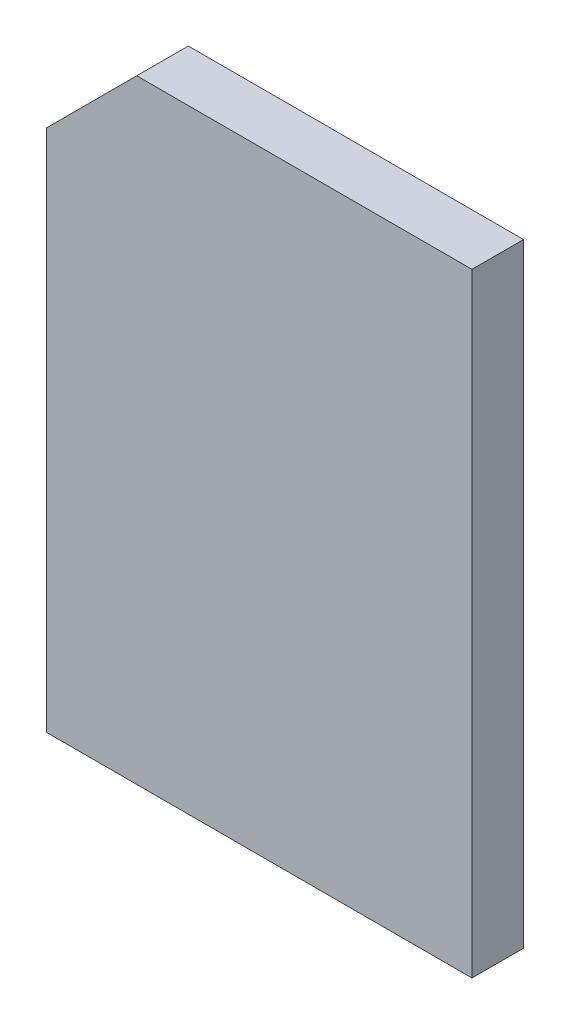
ISO-10303-21;
HEADER;
FILE_DESCRIPTION(('STEP AP214'),'2;1');
FILE_NAME('part.step','',(''),(''),'','','');
FILE_SCHEMA(('AUTOMOTIVE_DESIGN { 1 0 10303 214 1 1 1 1 }'));
ENDSEC;
DATA;
#1=APPLICATION_CONTEXT('core data for automotive mechanical design processes');
#2=APPLICATION_PROTOCOL_DEFINITION('international standard','automotive_design',2000,#1);
#3=PRODUCT_CONTEXT('',#1,'mechanical');
#4=PRODUCT('Part','Part','',(#3));
#5=PRODUCT_RELATED_PRODUCT_CATEGORY('part','',(#4));
#6=PRODUCT_DEFINITION_FORMATION('','',#4);
#7=PRODUCT_DEFINITION_CONTEXT('part definition',#1,'design');
#8=PRODUCT_DEFINITION('design','',#6,#7);
#9=PRODUCT_DEFINITION_SHAPE('','',#8);
#10=(LENGTH_UNIT() NAMED_UNIT(*) SI_UNIT(.MILLI.,.METRE.));
#11=(NAMED_UNIT(*) PLANE_ANGLE_UNIT() SI_UNIT($,.RADIAN.));
#12=(NAMED_UNIT(*) SI_UNIT($,.STERADIAN.) SOLID_ANGLE_UNIT());
#13=UNCERTAINTY_MEASURE_WITH_UNIT(LENGTH_MEASURE(1.E-05),#10,'distance_accuracy_value','');
#14=(GEOMETRIC_REPRESENTATION_CONTEXT(3) GLOBAL_UNCERTAINTY_ASSIGNED_CONTEXT((#13)) GLOBAL_UNIT_ASSIGNED_CONTEXT((#10,
#11,#12)) REPRESENTATION_CONTEXT('',''));
#15=CARTESIAN_POINT('',(0.,0.,0.));
#16=DIRECTION('',(0.,0.,1.));
#17=DIRECTION('',(1.,0.,0.));
#18=AXIS2_PLACEMENT_3D('',#15,#16,#17);
#19=CARTESIAN_POINT('',(-0.65,1.015,0.));
#20=DIRECTION('',(-0.707106781186547,0.707106781186548,0.));
#21=DIRECTION('',(0.,0.,1.));
#22=AXIS2_PLACEMENT_3D('',#19,#20,#21);
#23=PLANE('',#22);
#24=DIRECTION('',(0.707106781186548,0.707106781186547,0.));
#25=VECTOR('',#24,1.);
#26=CARTESIAN_POINT('',(-0.74125,0.92375,0.2));
#27=LINE('',#26,#25);
#28=CARTESIAN_POINT('',(-0.825,0.84,0.2));
#29=VERTEX_POINT('',#28);
#30=CARTESIAN_POINT('',(-0.475,1.19,0.2));
#31=VERTEX_POINT('',#30);
#32=EDGE_CURVE('E11',#29,#31,#27,.T.);
#33=ORIENTED_EDGE('',*,*,#32,.T.);
#34=DIRECTION('',(0.,0.,-1.));
#35=VECTOR('',#34,1.);
#36=CARTESIAN_POINT('',(-0.475,1.19,0.));
#37=LINE('',#36,#35);
#38=CARTESIAN_POINT('',(-0.475,1.19,0.));
#39=VERTEX_POINT('',#38);
#40=EDGE_CURVE('E24',#31,#39,#37,.T.);
#41=ORIENTED_EDGE('',*,*,#40,.T.);
#42=DIRECTION('',(-0.707106781186548,-0.707106781186547,0.));
#43=VECTOR('',#42,1.);
#44=CARTESIAN_POINT('',(-0.74125,0.92375,0.));
#45=LINE('',#44,#43);
#46=CARTESIAN_POINT('',(-0.825,0.84,0.));
#47=VERTEX_POINT('',#46);
#48=EDGE_CURVE('E101',#39,#47,#45,.T.);
#49=ORIENTED_EDGE('',*,*,#48,.T.);
#50=DIRECTION('',(0.,0.,1.));
#51=VECTOR('',#50,1.);
#52=CARTESIAN_POINT('',(-0.825,0.84,0.));
#53=LINE('',#52,#51);
#54=EDGE_CURVE('E99',#47,#29,#53,.T.);
#55=ORIENTED_EDGE('',*,*,#54,.T.);
#56=EDGE_LOOP('',(#33,#41,#49,#55));
#57=FACE_BOUND('',#56,.T.);
#58=ADVANCED_FACE('F17',(#57),#23,.T.);
#59=CARTESIAN_POINT('',(0.,0.,0.));
#60=DIRECTION('',(0.,0.,1.));
#61=DIRECTION('',(1.,0.,0.));
#62=AXIS2_PLACEMENT_3D('',#59,#60,#61);
#63=PLANE('',#62);
#64=ORIENTED_EDGE('',*,*,#48,.F.);
#65=DIRECTION('',(-1.,0.,0.));
#66=VECTOR('',#65,1.);
#67=CARTESIAN_POINT('',(0.825,1.19,0.));
#68=LINE('',#67,#66);
#69=CARTESIAN_POINT('',(0.825,1.19,0.));
#70=VERTEX_POINT('',#69);
#71=EDGE_CURVE('E96',#70,#39,#68,.T.);
#72=ORIENTED_EDGE('',*,*,#71,.F.);
#73=DIRECTION('',(0.,1.,0.));
#74=VECTOR('',#73,1.);
#75=CARTESIAN_POINT('',(0.825,-1.19,0.));
#76=LINE('',#75,#74);
#77=CARTESIAN_POINT('',(0.825,-1.19,0.));
#78=VERTEX_POINT('',#77);
#79=EDGE_CURVE('E93',#78,#70,#76,.T.);
#80=ORIENTED_EDGE('',*,*,#79,.F.);
#81=DIRECTION('',(1.,0.,0.));
#82=VECTOR('',#81,1.);
#83=CARTESIAN_POINT('',(-0.825,-1.19,0.));
#84=LINE('',#83,#82);
#85=CARTESIAN_POINT('',(-0.825,-1.19,0.));
#86=VERTEX_POINT('',#85);
#87=EDGE_CURVE('E91',#86,#78,#84,.T.);
#88=ORIENTED_EDGE('',*,*,#87,.F.);
#89=DIRECTION('',(0.,-1.,0.));
#90=VECTOR('',#89,1.);
#91=CARTESIAN_POINT('',(-0.825,1.19,0.));
#92=LINE('',#91,#90);
#93=EDGE_CURVE('E77',#47,#86,#92,.T.);
#94=ORIENTED_EDGE('',*,*,#93,.F.);
#95=EDGE_LOOP('',(#64,#72,#80,#88,#94));
#96=FACE_BOUND('',#95,.T.);
#97=ADVANCED_FACE('F105',(#96),#63,.F.);
#98=CARTESIAN_POINT('',(0.825,1.19,0.));
#99=DIRECTION('',(0.,1.,0.));
#100=DIRECTION('',(-1.,0.,0.));
#101=AXIS2_PLACEMENT_3D('',#98,#99,#100);
#102=PLANE('',#101);
#103=ORIENTED_EDGE('',*,*,#40,.F.);
#104=DIRECTION('',(-1.,0.,0.));
#105=VECTOR('',#104,1.);
#106=CARTESIAN_POINT('',(0.825,1.19,0.2));
#107=LINE('',#106,#105);
#108=CARTESIAN_POINT('',(0.825,1.19,0.2));
#109=VERTEX_POINT('',#108);
#110=EDGE_CURVE('E88',#109,#31,#107,.T.);
#111=ORIENTED_EDGE('',*,*,#110,.F.);
#112=DIRECTION('',(0.,0.,1.));
#113=VECTOR('',#112,1.);
#114=CARTESIAN_POINT('',(0.825,1.19,0.));
#115=LINE('',#114,#113);
#116=EDGE_CURVE('E85',#70,#109,#115,.T.);
#117=ORIENTED_EDGE('',*,*,#116,.F.);
#118=ORIENTED_EDGE('',*,*,#71,.T.);
#119=EDGE_LOOP('',(#103,#111,#117,#118));
#120=FACE_BOUND('',#119,.T.);
#121=ADVANCED_FACE('F107',(#120),#102,.T.);
#122=CARTESIAN_POINT('',(0.825,-1.19,0.));
#123=DIRECTION('',(1.,0.,0.));
#124=DIRECTION('',(0.,1.,0.));
#125=AXIS2_PLACEMENT_3D('',#122,#123,#124);
#126=PLANE('',#125);
#127=ORIENTED_EDGE('',*,*,#79,.T.);
#128=ORIENTED_EDGE('',*,*,#116,.T.);
#129=DIRECTION('',(0.,1.,0.));
#130=VECTOR('',#129,1.);
#131=CARTESIAN_POINT('',(0.825,-1.19,0.2));
#132=LINE('',#131,#130);
#133=CARTESIAN_POINT('',(0.825,-1.19,0.2));
#134=VERTEX_POINT('',#133);
#135=EDGE_CURVE('E83',#134,#109,#132,.T.);
#136=ORIENTED_EDGE('',*,*,#135,.F.);
#137=DIRECTION('',(0.,0.,1.));
#138=VECTOR('',#137,1.);
#139=CARTESIAN_POINT('',(0.825,-1.19,0.));
#140=LINE('',#139,#138);
#141=EDGE_CURVE('E67',#78,#134,#140,.T.);
#142=ORIENTED_EDGE('',*,*,#141,.F.);
#143=EDGE_LOOP('',(#127,#128,#136,#142));
#144=FACE_BOUND('',#143,.T.);
#145=ADVANCED_FACE('F109',(#144),#126,.T.);
#146=CARTESIAN_POINT('',(-0.825,-1.19,0.));
#147=DIRECTION('',(0.,-1.,0.));
#148=DIRECTION('',(1.,0.,0.));
#149=AXIS2_PLACEMENT_3D('',#146,#147,#148);
#150=PLANE('',#149);
#151=ORIENTED_EDGE('',*,*,#87,.T.);
#152=ORIENTED_EDGE('',*,*,#141,.T.);
#153=DIRECTION('',(1.,0.,0.));
#154=VECTOR('',#153,1.);
#155=CARTESIAN_POINT('',(-0.825,-1.19,0.2));
#156=LINE('',#155,#154);
#157=CARTESIAN_POINT('',(-0.825,-1.19,0.2));
#158=VERTEX_POINT('',#157);
#159=EDGE_CURVE('E61',#158,#134,#156,.T.);
#160=ORIENTED_EDGE('',*,*,#159,.F.);
#161=DIRECTION('',(0.,0.,1.));
#162=VECTOR('',#161,1.);
#163=CARTESIAN_POINT('',(-0.825,-1.19,0.));
#164=LINE('',#163,#162);
#165=EDGE_CURVE('E65',#86,#158,#164,.T.);
#166=ORIENTED_EDGE('',*,*,#165,.F.);
#167=EDGE_LOOP('',(#151,#152,#160,#166));
#168=FACE_BOUND('',#167,.T.);
#169=ADVANCED_FACE('F64',(#168),#150,.T.);
#170=CARTESIAN_POINT('',(-0.825,1.19,0.));
#171=DIRECTION('',(-1.,0.,0.));
#172=DIRECTION('',(0.,-1.,0.));
#173=AXIS2_PLACEMENT_3D('',#170,#171,#172);
#174=PLANE('',#173);
#175=ORIENTED_EDGE('',*,*,#54,.F.);
#176=ORIENTED_EDGE('',*,*,#93,.T.);
#177=ORIENTED_EDGE('',*,*,#165,.T.);
#178=DIRECTION('',(0.,-1.,0.));
#179=VECTOR('',#178,1.);
#180=CARTESIAN_POINT('',(-0.825,1.19,0.2));
#181=LINE('',#180,#179);
#182=EDGE_CURVE('E75',#29,#158,#181,.T.);
#183=ORIENTED_EDGE('',*,*,#182,.F.);
#184=EDGE_LOOP('',(#175,#176,#177,#183));
#185=FACE_BOUND('',#184,.T.);
#186=ADVANCED_FACE('F74',(#185),#174,.T.);
#187=CARTESIAN_POINT('',(0.,0.,0.2));
#188=DIRECTION('',(0.,0.,1.));
#189=DIRECTION('',(1.,0.,0.));
#190=AXIS2_PLACEMENT_3D('',#187,#188,#189);
#191=PLANE('',#190);
#192=ORIENTED_EDGE('',*,*,#32,.F.);
#193=ORIENTED_EDGE('',*,*,#182,.T.);
#194=ORIENTED_EDGE('',*,*,#159,.T.);
#195=ORIENTED_EDGE('',*,*,#135,.T.);
#196=ORIENTED_EDGE('',*,*,#110,.T.);
#197=EDGE_LOOP('',(#192,#193,#194,#195,#196));
#198=FACE_BOUND('',#197,.T.);
#199=ADVANCED_FACE('F79',(#198),#191,.T.);
#200=CLOSED_SHELL('',(#58,#97,#121,#145,#169,#186,#199));
#201=MANIFOLD_SOLID_BREP('B1',#200);
#202=ADVANCED_BREP_SHAPE_REPRESENTATION('',(#18,#201),#14);
#203=SHAPE_DEFINITION_REPRESENTATION(#9,#202);
ENDSEC;
END-ISO-10303-21;
